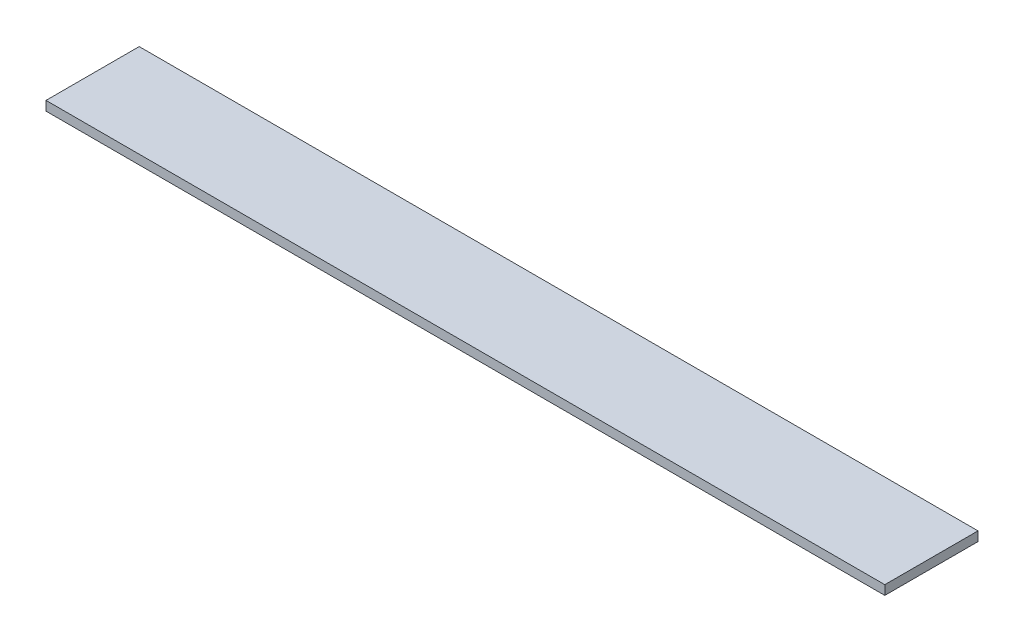
ISO-10303-21;
HEADER;
FILE_DESCRIPTION(('STEP AP214'),'2;1');
FILE_NAME('part.step','',(''),(''),'','','');
FILE_SCHEMA(('AUTOMOTIVE_DESIGN { 1 0 10303 214 1 1 1 1 }'));
ENDSEC;
DATA;
#1=APPLICATION_CONTEXT('core data for automotive mechanical design processes');
#2=APPLICATION_PROTOCOL_DEFINITION('international standard','automotive_design',2000,#1);
#3=PRODUCT_CONTEXT('',#1,'mechanical');
#4=PRODUCT('Part','Part','',(#3));
#5=PRODUCT_RELATED_PRODUCT_CATEGORY('part','',(#4));
#6=PRODUCT_DEFINITION_FORMATION('','',#4);
#7=PRODUCT_DEFINITION_CONTEXT('part definition',#1,'design');
#8=PRODUCT_DEFINITION('design','',#6,#7);
#9=PRODUCT_DEFINITION_SHAPE('','',#8);
#10=(LENGTH_UNIT() NAMED_UNIT(*) SI_UNIT(.MILLI.,.METRE.));
#11=(NAMED_UNIT(*) PLANE_ANGLE_UNIT() SI_UNIT($,.RADIAN.));
#12=(NAMED_UNIT(*) SI_UNIT($,.STERADIAN.) SOLID_ANGLE_UNIT());
#13=UNCERTAINTY_MEASURE_WITH_UNIT(LENGTH_MEASURE(1.E-05),#10,'distance_accuracy_value','');
#14=(GEOMETRIC_REPRESENTATION_CONTEXT(3) GLOBAL_UNCERTAINTY_ASSIGNED_CONTEXT((#13)) GLOBAL_UNIT_ASSIGNED_CONTEXT((#10,
#11,#12)) REPRESENTATION_CONTEXT('',''));
#15=CARTESIAN_POINT('',(0.,0.,0.));
#16=DIRECTION('',(0.,0.,1.));
#17=DIRECTION('',(1.,0.,0.));
#18=AXIS2_PLACEMENT_3D('',#15,#16,#17);
#19=CARTESIAN_POINT('',(0.,10.,0.));
#20=DIRECTION('',(1.,0.,0.));
#21=DIRECTION('',(0.,0.,-1.));
#22=AXIS2_PLACEMENT_3D('',#19,#20,#21);
#23=PLANE('',#22);
#24=DIRECTION('',(0.,0.,1.));
#25=VECTOR('',#24,1.);
#26=CARTESIAN_POINT('',(0.,0.,0.));
#27=LINE('',#26,#25);
#28=CARTESIAN_POINT('',(0.,0.,-100.));
#29=VERTEX_POINT('',#28);
#30=CARTESIAN_POINT('',(0.,0.,0.));
#31=VERTEX_POINT('',#30);
#32=EDGE_CURVE('E94',#29,#31,#27,.T.);
#33=ORIENTED_EDGE('',*,*,#32,.T.);
#34=DIRECTION('',(0.,-1.,0.));
#35=VECTOR('',#34,1.);
#36=CARTESIAN_POINT('',(0.,10.,0.));
#37=LINE('',#36,#35);
#38=CARTESIAN_POINT('',(0.,10.,0.));
#39=VERTEX_POINT('',#38);
#40=EDGE_CURVE('E11',#39,#31,#37,.T.);
#41=ORIENTED_EDGE('',*,*,#40,.F.);
#42=DIRECTION('',(0.,0.,1.));
#43=VECTOR('',#42,1.);
#44=CARTESIAN_POINT('',(0.,10.,0.));
#45=LINE('',#44,#43);
#46=CARTESIAN_POINT('',(0.,10.,-100.));
#47=VERTEX_POINT('',#46);
#48=EDGE_CURVE('E82',#47,#39,#45,.T.);
#49=ORIENTED_EDGE('',*,*,#48,.F.);
#50=DIRECTION('',(0.,-1.,0.));
#51=VECTOR('',#50,1.);
#52=CARTESIAN_POINT('',(0.,10.,-100.));
#53=LINE('',#52,#51);
#54=EDGE_CURVE('E90',#47,#29,#53,.T.);
#55=ORIENTED_EDGE('',*,*,#54,.T.);
#56=EDGE_LOOP('',(#33,#41,#49,#55));
#57=FACE_BOUND('',#56,.T.);
#58=ADVANCED_FACE('F31',(#57),#23,.F.);
#59=CARTESIAN_POINT('',(0.,10.,0.));
#60=DIRECTION('',(0.,0.,-1.));
#61=DIRECTION('',(-1.,0.,0.));
#62=AXIS2_PLACEMENT_3D('',#59,#60,#61);
#63=PLANE('',#62);
#64=DIRECTION('',(1.,0.,0.));
#65=VECTOR('',#64,1.);
#66=CARTESIAN_POINT('',(0.,0.,0.));
#67=LINE('',#66,#65);
#68=CARTESIAN_POINT('',(900.,0.,0.));
#69=VERTEX_POINT('',#68);
#70=EDGE_CURVE('E86',#31,#69,#67,.T.);
#71=ORIENTED_EDGE('',*,*,#70,.T.);
#72=DIRECTION('',(0.,-1.,0.));
#73=VECTOR('',#72,1.);
#74=CARTESIAN_POINT('',(900.,10.,0.));
#75=LINE('',#74,#73);
#76=CARTESIAN_POINT('',(900.,10.,0.));
#77=VERTEX_POINT('',#76);
#78=EDGE_CURVE('E39',#77,#69,#75,.T.);
#79=ORIENTED_EDGE('',*,*,#78,.F.);
#80=DIRECTION('',(1.,0.,0.));
#81=VECTOR('',#80,1.);
#82=CARTESIAN_POINT('',(0.,10.,0.));
#83=LINE('',#82,#81);
#84=EDGE_CURVE('E77',#39,#77,#83,.T.);
#85=ORIENTED_EDGE('',*,*,#84,.F.);
#86=ORIENTED_EDGE('',*,*,#40,.T.);
#87=EDGE_LOOP('',(#71,#79,#85,#86));
#88=FACE_BOUND('',#87,.T.);
#89=ADVANCED_FACE('F85',(#88),#63,.F.);
#90=CARTESIAN_POINT('',(900.,10.,0.));
#91=DIRECTION('',(-1.,0.,0.));
#92=DIRECTION('',(0.,0.,1.));
#93=AXIS2_PLACEMENT_3D('',#90,#91,#92);
#94=PLANE('',#93);
#95=DIRECTION('',(0.,0.,-1.));
#96=VECTOR('',#95,1.);
#97=CARTESIAN_POINT('',(900.,0.,0.));
#98=LINE('',#97,#96);
#99=CARTESIAN_POINT('',(900.,0.,-100.));
#100=VERTEX_POINT('',#99);
#101=EDGE_CURVE('E64',#69,#100,#98,.T.);
#102=ORIENTED_EDGE('',*,*,#101,.T.);
#103=DIRECTION('',(0.,-1.,0.));
#104=VECTOR('',#103,1.);
#105=CARTESIAN_POINT('',(900.,10.,-100.));
#106=LINE('',#105,#104);
#107=CARTESIAN_POINT('',(900.,10.,-100.));
#108=VERTEX_POINT('',#107);
#109=EDGE_CURVE('E87',#108,#100,#106,.T.);
#110=ORIENTED_EDGE('',*,*,#109,.F.);
#111=DIRECTION('',(0.,0.,-1.));
#112=VECTOR('',#111,1.);
#113=CARTESIAN_POINT('',(900.,10.,0.));
#114=LINE('',#113,#112);
#115=EDGE_CURVE('E80',#77,#108,#114,.T.);
#116=ORIENTED_EDGE('',*,*,#115,.F.);
#117=ORIENTED_EDGE('',*,*,#78,.T.);
#118=EDGE_LOOP('',(#102,#110,#116,#117));
#119=FACE_BOUND('',#118,.T.);
#120=ADVANCED_FACE('F88',(#119),#94,.F.);
#121=CARTESIAN_POINT('',(0.,10.,-100.));
#122=DIRECTION('',(0.,0.,1.));
#123=DIRECTION('',(1.,0.,0.));
#124=AXIS2_PLACEMENT_3D('',#121,#122,#123);
#125=PLANE('',#124);
#126=DIRECTION('',(-1.,0.,0.));
#127=VECTOR('',#126,1.);
#128=CARTESIAN_POINT('',(0.,0.,-100.));
#129=LINE('',#128,#127);
#130=EDGE_CURVE('E70',#100,#29,#129,.T.);
#131=ORIENTED_EDGE('',*,*,#130,.T.);
#132=ORIENTED_EDGE('',*,*,#54,.F.);
#133=DIRECTION('',(-1.,0.,0.));
#134=VECTOR('',#133,1.);
#135=CARTESIAN_POINT('',(0.,10.,-100.));
#136=LINE('',#135,#134);
#137=EDGE_CURVE('E47',#108,#47,#136,.T.);
#138=ORIENTED_EDGE('',*,*,#137,.F.);
#139=ORIENTED_EDGE('',*,*,#109,.T.);
#140=EDGE_LOOP('',(#131,#132,#138,#139));
#141=FACE_BOUND('',#140,.T.);
#142=ADVANCED_FACE('F101',(#141),#125,.F.);
#143=CARTESIAN_POINT('',(0.,10.,-100.));
#144=DIRECTION('',(0.,-1.,0.));
#145=DIRECTION('',(0.,0.,-1.));
#146=AXIS2_PLACEMENT_3D('',#143,#144,#145);
#147=PLANE('',#146);
#148=ORIENTED_EDGE('',*,*,#48,.T.);
#149=ORIENTED_EDGE('',*,*,#84,.T.);
#150=ORIENTED_EDGE('',*,*,#115,.T.);
#151=ORIENTED_EDGE('',*,*,#137,.T.);
#152=EDGE_LOOP('',(#148,#149,#150,#151));
#153=FACE_BOUND('',#152,.T.);
#154=ADVANCED_FACE('F78',(#153),#147,.F.);
#155=CARTESIAN_POINT('',(0.,0.,-100.));
#156=DIRECTION('',(0.,-1.,0.));
#157=DIRECTION('',(0.,0.,-1.));
#158=AXIS2_PLACEMENT_3D('',#155,#156,#157);
#159=PLANE('',#158);
#160=ORIENTED_EDGE('',*,*,#32,.F.);
#161=ORIENTED_EDGE('',*,*,#130,.F.);
#162=ORIENTED_EDGE('',*,*,#101,.F.);
#163=ORIENTED_EDGE('',*,*,#70,.F.);
#164=EDGE_LOOP('',(#160,#161,#162,#163));
#165=FACE_BOUND('',#164,.T.);
#166=ADVANCED_FACE('F104',(#165),#159,.T.);
#167=CLOSED_SHELL('',(#58,#89,#120,#142,#154,#166));
#168=MANIFOLD_SOLID_BREP('B2',#167);
#169=ADVANCED_BREP_SHAPE_REPRESENTATION('',(#18,#168),#14);
#170=SHAPE_DEFINITION_REPRESENTATION(#9,#169);
ENDSEC;
END-ISO-10303-21;
